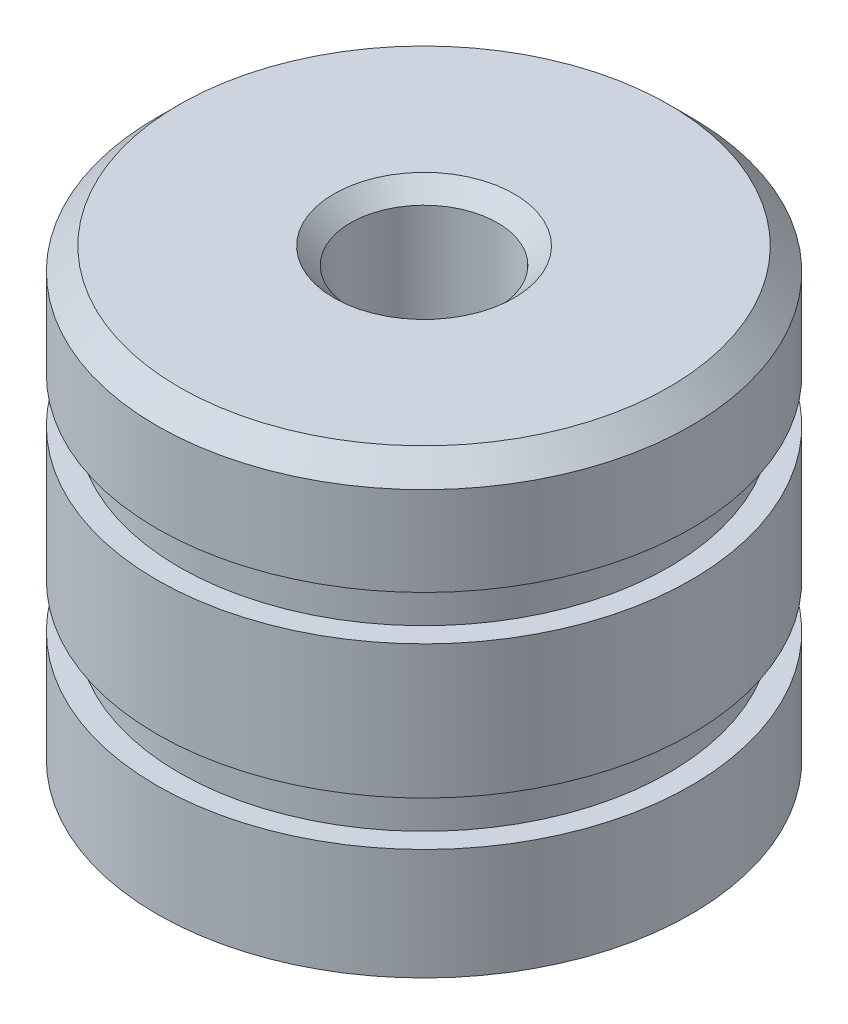
ISO-10303-21;
HEADER;
FILE_DESCRIPTION(('STEP AP214'),'2;1');
FILE_NAME('part.step','',(''),(''),'','','');
FILE_SCHEMA(('AUTOMOTIVE_DESIGN { 1 0 10303 214 1 1 1 1 }'));
ENDSEC;
DATA;
#1=APPLICATION_CONTEXT('core data for automotive mechanical design processes');
#2=APPLICATION_PROTOCOL_DEFINITION('international standard','automotive_design',2000,#1);
#3=PRODUCT_CONTEXT('',#1,'mechanical');
#4=PRODUCT('Part','Part','',(#3));
#5=PRODUCT_RELATED_PRODUCT_CATEGORY('part','',(#4));
#6=PRODUCT_DEFINITION_FORMATION('','',#4);
#7=PRODUCT_DEFINITION_CONTEXT('part definition',#1,'design');
#8=PRODUCT_DEFINITION('design','',#6,#7);
#9=PRODUCT_DEFINITION_SHAPE('','',#8);
#10=(LENGTH_UNIT() NAMED_UNIT(*) SI_UNIT(.MILLI.,.METRE.));
#11=(NAMED_UNIT(*) PLANE_ANGLE_UNIT() SI_UNIT($,.RADIAN.));
#12=(NAMED_UNIT(*) SI_UNIT($,.STERADIAN.) SOLID_ANGLE_UNIT());
#13=UNCERTAINTY_MEASURE_WITH_UNIT(LENGTH_MEASURE(1.E-05),#10,'distance_accuracy_value','');
#14=(GEOMETRIC_REPRESENTATION_CONTEXT(3) GLOBAL_UNCERTAINTY_ASSIGNED_CONTEXT((#13)) GLOBAL_UNIT_ASSIGNED_CONTEXT((#10,
#11,#12)) REPRESENTATION_CONTEXT('',''));
#15=CARTESIAN_POINT('',(0.,0.,0.));
#16=DIRECTION('',(0.,0.,1.));
#17=DIRECTION('',(1.,0.,0.));
#18=AXIS2_PLACEMENT_3D('',#15,#16,#17);
#19=CARTESIAN_POINT('',(0.,5.,0.));
#20=DIRECTION('',(0.,-1.,0.));
#21=DIRECTION('',(0.,0.,-1.));
#22=AXIS2_PLACEMENT_3D('',#19,#20,#21);
#23=CYLINDRICAL_SURFACE('',#22,6.);
#24=CARTESIAN_POINT('',(0.,1.5,0.));
#25=DIRECTION('',(0.,1.,0.));
#26=DIRECTION('',(0.,0.,1.));
#27=AXIS2_PLACEMENT_3D('',#24,#25,#26);
#28=CIRCLE('',#27,6.);
#29=CARTESIAN_POINT('',(0.,1.5,6.));
#30=VERTEX_POINT('',#29);
#31=EDGE_CURVE('E81',#30,#30,#28,.T.);
#32=ORIENTED_EDGE('',*,*,#31,.F.);
#33=EDGE_LOOP('',(#32));
#34=FACE_BOUND('',#33,.T.);
#35=CARTESIAN_POINT('',(0.,-1.5,0.));
#36=DIRECTION('',(0.,1.,0.));
#37=DIRECTION('',(0.,0.,1.));
#38=AXIS2_PLACEMENT_3D('',#35,#36,#37);
#39=CIRCLE('',#38,6.);
#40=CARTESIAN_POINT('',(0.,-1.5,6.));
#41=VERTEX_POINT('',#40);
#42=EDGE_CURVE('E69',#41,#41,#39,.T.);
#43=ORIENTED_EDGE('',*,*,#42,.T.);
#44=EDGE_LOOP('',(#43));
#45=FACE_BOUND('',#44,.T.);
#46=ADVANCED_FACE('F36',(#34,#45),#23,.T.);
#47=CARTESIAN_POINT('',(0.,1.5,0.));
#48=DIRECTION('',(0.,1.,0.));
#49=DIRECTION('',(0.,0.,1.));
#50=AXIS2_PLACEMENT_3D('',#47,#48,#49);
#51=PLANE('',#50);
#52=CARTESIAN_POINT('',(0.,1.5,0.));
#53=DIRECTION('',(0.,1.,0.));
#54=DIRECTION('',(0.,0.,1.));
#55=AXIS2_PLACEMENT_3D('',#52,#53,#54);
#56=CIRCLE('',#55,5.5);
#57=CARTESIAN_POINT('',(0.,1.5,5.5));
#58=VERTEX_POINT('',#57);
#59=EDGE_CURVE('E75',#58,#58,#56,.T.);
#60=ORIENTED_EDGE('',*,*,#59,.F.);
#61=EDGE_LOOP('',(#60));
#62=FACE_BOUND('',#61,.T.);
#63=ORIENTED_EDGE('',*,*,#31,.T.);
#64=EDGE_LOOP('',(#63));
#65=FACE_BOUND('',#64,.T.);
#66=ADVANCED_FACE('F104',(#62,#65),#51,.T.);
#67=CARTESIAN_POINT('',(0.,2.5,0.));
#68=DIRECTION('',(0.,1.,0.));
#69=DIRECTION('',(0.,0.,1.));
#70=AXIS2_PLACEMENT_3D('',#67,#68,#69);
#71=PLANE('',#70);
#72=CARTESIAN_POINT('',(0.,2.5,0.));
#73=DIRECTION('',(0.,1.,0.));
#74=DIRECTION('',(0.,0.,1.));
#75=AXIS2_PLACEMENT_3D('',#72,#73,#74);
#76=CIRCLE('',#75,5.5);
#77=CARTESIAN_POINT('',(0.,2.5,5.5));
#78=VERTEX_POINT('',#77);
#79=EDGE_CURVE('E72',#78,#78,#76,.T.);
#80=ORIENTED_EDGE('',*,*,#79,.T.);
#81=EDGE_LOOP('',(#80));
#82=FACE_BOUND('',#81,.T.);
#83=CARTESIAN_POINT('',(0.,2.5,0.));
#84=DIRECTION('',(0.,1.,0.));
#85=DIRECTION('',(0.,0.,1.));
#86=AXIS2_PLACEMENT_3D('',#83,#84,#85);
#87=CIRCLE('',#86,6.);
#88=CARTESIAN_POINT('',(0.,2.5,6.));
#89=VERTEX_POINT('',#88);
#90=EDGE_CURVE('E78',#89,#89,#87,.T.);
#91=ORIENTED_EDGE('',*,*,#90,.F.);
#92=EDGE_LOOP('',(#91));
#93=FACE_BOUND('',#92,.T.);
#94=ADVANCED_FACE('F109',(#82,#93),#71,.F.);
#95=CARTESIAN_POINT('',(0.,1.5,0.));
#96=DIRECTION('',(0.,1.,0.));
#97=DIRECTION('',(0.,0.,1.));
#98=AXIS2_PLACEMENT_3D('',#95,#96,#97);
#99=CYLINDRICAL_SURFACE('',#98,5.5);
#100=ORIENTED_EDGE('',*,*,#59,.T.);
#101=EDGE_LOOP('',(#100));
#102=FACE_BOUND('',#101,.T.);
#103=ORIENTED_EDGE('',*,*,#79,.F.);
#104=EDGE_LOOP('',(#103));
#105=FACE_BOUND('',#104,.T.);
#106=ADVANCED_FACE('F125',(#102,#105),#99,.T.);
#107=CARTESIAN_POINT('',(0.,5.,0.));
#108=DIRECTION('',(0.,1.,0.));
#109=DIRECTION('',(0.,0.,1.));
#110=AXIS2_PLACEMENT_3D('',#107,#108,#109);
#111=PLANE('',#110);
#112=CARTESIAN_POINT('',(0.,5.,0.));
#113=DIRECTION('',(0.,1.,0.));
#114=DIRECTION('',(0.,0.,1.));
#115=AXIS2_PLACEMENT_3D('',#112,#113,#114);
#116=CIRCLE('',#115,2.025);
#117=CARTESIAN_POINT('',(0.,5.,2.025));
#118=VERTEX_POINT('',#117);
#119=EDGE_CURVE('E62',#118,#118,#116,.T.);
#120=ORIENTED_EDGE('',*,*,#119,.F.);
#121=EDGE_LOOP('',(#120));
#122=FACE_BOUND('',#121,.T.);
#123=CARTESIAN_POINT('',(0.,5.,0.));
#124=DIRECTION('',(0.,1.,0.));
#125=DIRECTION('',(0.,0.,1.));
#126=AXIS2_PLACEMENT_3D('',#123,#124,#125);
#127=CIRCLE('',#126,5.50000000000001);
#128=CARTESIAN_POINT('',(0.,5.,5.50000000000001));
#129=VERTEX_POINT('',#128);
#130=EDGE_CURVE('E43',#129,#129,#127,.T.);
#131=ORIENTED_EDGE('',*,*,#130,.T.);
#132=EDGE_LOOP('',(#131));
#133=FACE_BOUND('',#132,.T.);
#134=ADVANCED_FACE('F91',(#122,#133),#111,.T.);
#135=CARTESIAN_POINT('',(0.,4.5,0.));
#136=DIRECTION('',(0.,1.,0.));
#137=DIRECTION('',(0.,0.,1.));
#138=AXIS2_PLACEMENT_3D('',#135,#136,#137);
#139=CIRCLE('',#138,6.);
#140=CARTESIAN_POINT('',(0.,4.5,6.));
#141=VERTEX_POINT('',#140);
#142=EDGE_CURVE('E11',#141,#141,#139,.F.);
#143=ORIENTED_EDGE('',*,*,#142,.T.);
#144=EDGE_LOOP('',(#143));
#145=FACE_BOUND('',#144,.T.);
#146=ORIENTED_EDGE('',*,*,#90,.T.);
#147=EDGE_LOOP('',(#146));
#148=FACE_BOUND('',#147,.T.);
#149=ADVANCED_FACE('F101',(#145,#148),#23,.T.);
#150=CARTESIAN_POINT('',(0.,-1.5,0.));
#151=DIRECTION('',(0.,-1.,0.));
#152=DIRECTION('',(0.,0.,1.));
#153=AXIS2_PLACEMENT_3D('',#150,#151,#152);
#154=PLANE('',#153);
#155=ORIENTED_EDGE('',*,*,#42,.F.);
#156=EDGE_LOOP('',(#155));
#157=FACE_BOUND('',#156,.T.);
#158=CARTESIAN_POINT('',(0.,-1.5,0.));
#159=DIRECTION('',(0.,1.,0.));
#160=DIRECTION('',(0.,0.,1.));
#161=AXIS2_PLACEMENT_3D('',#158,#159,#160);
#162=CIRCLE('',#161,5.5);
#163=CARTESIAN_POINT('',(0.,-1.5,5.5));
#164=VERTEX_POINT('',#163);
#165=EDGE_CURVE('E59',#164,#164,#162,.T.);
#166=ORIENTED_EDGE('',*,*,#165,.T.);
#167=EDGE_LOOP('',(#166));
#168=FACE_BOUND('',#167,.T.);
#169=ADVANCED_FACE('F116',(#157,#168),#154,.T.);
#170=CARTESIAN_POINT('',(0.,-2.5,0.));
#171=DIRECTION('',(0.,-1.,0.));
#172=DIRECTION('',(0.,0.,1.));
#173=AXIS2_PLACEMENT_3D('',#170,#171,#172);
#174=PLANE('',#173);
#175=CARTESIAN_POINT('',(0.,-2.5,0.));
#176=DIRECTION('',(0.,1.,0.));
#177=DIRECTION('',(0.,0.,1.));
#178=AXIS2_PLACEMENT_3D('',#175,#176,#177);
#179=CIRCLE('',#178,6.);
#180=CARTESIAN_POINT('',(0.,-2.5,6.));
#181=VERTEX_POINT('',#180);
#182=EDGE_CURVE('E67',#181,#181,#179,.T.);
#183=ORIENTED_EDGE('',*,*,#182,.T.);
#184=EDGE_LOOP('',(#183));
#185=FACE_BOUND('',#184,.T.);
#186=CARTESIAN_POINT('',(0.,-2.5,0.));
#187=DIRECTION('',(0.,1.,0.));
#188=DIRECTION('',(0.,0.,1.));
#189=AXIS2_PLACEMENT_3D('',#186,#187,#188);
#190=CIRCLE('',#189,5.5);
#191=CARTESIAN_POINT('',(0.,-2.5,5.5));
#192=VERTEX_POINT('',#191);
#193=EDGE_CURVE('E55',#192,#192,#190,.T.);
#194=ORIENTED_EDGE('',*,*,#193,.F.);
#195=EDGE_LOOP('',(#194));
#196=FACE_BOUND('',#195,.T.);
#197=ADVANCED_FACE('F122',(#185,#196),#174,.F.);
#198=CARTESIAN_POINT('',(0.,-1.5,0.));
#199=DIRECTION('',(0.,-1.,0.));
#200=DIRECTION('',(0.,0.,-1.));
#201=AXIS2_PLACEMENT_3D('',#198,#199,#200);
#202=CYLINDRICAL_SURFACE('',#201,5.5);
#203=ORIENTED_EDGE('',*,*,#165,.F.);
#204=EDGE_LOOP('',(#203));
#205=FACE_BOUND('',#204,.T.);
#206=ORIENTED_EDGE('',*,*,#193,.T.);
#207=EDGE_LOOP('',(#206));
#208=FACE_BOUND('',#207,.T.);
#209=ADVANCED_FACE('F140',(#205,#208),#202,.T.);
#210=CARTESIAN_POINT('',(0.,-5.,0.));
#211=DIRECTION('',(0.,1.,0.));
#212=DIRECTION('',(0.,0.,1.));
#213=AXIS2_PLACEMENT_3D('',#210,#211,#212);
#214=PLANE('',#213);
#215=CARTESIAN_POINT('',(0.,-5.,0.));
#216=DIRECTION('',(0.,1.,0.));
#217=DIRECTION('',(0.,0.,1.));
#218=AXIS2_PLACEMENT_3D('',#215,#216,#217);
#219=CIRCLE('',#218,6.);
#220=CARTESIAN_POINT('',(0.,-5.,6.));
#221=VERTEX_POINT('',#220);
#222=EDGE_CURVE('E84',#221,#221,#219,.T.);
#223=ORIENTED_EDGE('',*,*,#222,.F.);
#224=EDGE_LOOP('',(#223));
#225=FACE_BOUND('',#224,.T.);
#226=ADVANCED_FACE('F99',(#225),#214,.F.);
#227=ORIENTED_EDGE('',*,*,#182,.F.);
#228=EDGE_LOOP('',(#227));
#229=FACE_BOUND('',#228,.T.);
#230=ORIENTED_EDGE('',*,*,#222,.T.);
#231=EDGE_LOOP('',(#230));
#232=FACE_BOUND('',#231,.T.);
#233=ADVANCED_FACE('F94',(#229,#232),#23,.T.);
#234=CARTESIAN_POINT('',(0.,5.,0.));
#235=DIRECTION('',(0.,-1.,0.));
#236=DIRECTION('',(0.,0.,-1.));
#237=AXIS2_PLACEMENT_3D('',#234,#235,#236);
#238=CONICAL_SURFACE('',#237,5.50000000000001,0.785398163397444);
#239=ORIENTED_EDGE('',*,*,#142,.F.);
#240=EDGE_LOOP('',(#239));
#241=FACE_BOUND('',#240,.T.);
#242=ORIENTED_EDGE('',*,*,#130,.F.);
#243=EDGE_LOOP('',(#242));
#244=FACE_BOUND('',#243,.T.);
#245=ADVANCED_FACE('F38',(#241,#244),#238,.T.);
#246=CARTESIAN_POINT('',(0.,-3.,0.));
#247=DIRECTION('',(0.,1.,0.));
#248=DIRECTION('',(0.,0.,1.));
#249=AXIS2_PLACEMENT_3D('',#246,#247,#248);
#250=CONICAL_SURFACE('',#249,1.65,1.02974425867665);
#251=CARTESIAN_POINT('',(0.,-3.99142002139548,0.));
#252=VERTEX_POINT('',#251);
#253=VERTEX_LOOP('',#252);
#254=FACE_BOUND('',#253,.T.);
#255=CARTESIAN_POINT('',(0.,-3.,0.));
#256=DIRECTION('',(0.,1.,0.));
#257=DIRECTION('',(0.,0.,1.));
#258=AXIS2_PLACEMENT_3D('',#255,#256,#257);
#259=CIRCLE('',#258,1.65);
#260=CARTESIAN_POINT('',(0.,-3.,1.65));
#261=VERTEX_POINT('',#260);
#262=EDGE_CURVE('E53',#261,#261,#259,.T.);
#263=ORIENTED_EDGE('',*,*,#262,.T.);
#264=EDGE_LOOP('',(#263));
#265=FACE_BOUND('',#264,.T.);
#266=ADVANCED_FACE('F46',(#254,#265),#250,.F.);
#267=CARTESIAN_POINT('',(0.,5.,0.));
#268=DIRECTION('',(0.,1.,0.));
#269=DIRECTION('',(0.,0.,1.));
#270=AXIS2_PLACEMENT_3D('',#267,#268,#269);
#271=CYLINDRICAL_SURFACE('',#270,1.65);
#272=ORIENTED_EDGE('',*,*,#262,.F.);
#273=EDGE_LOOP('',(#272));
#274=FACE_BOUND('',#273,.T.);
#275=CARTESIAN_POINT('',(0.,4.625,0.));
#276=DIRECTION('',(0.,1.,0.));
#277=DIRECTION('',(0.,0.,1.));
#278=AXIS2_PLACEMENT_3D('',#275,#276,#277);
#279=CIRCLE('',#278,1.65);
#280=CARTESIAN_POINT('',(0.,4.625,1.65));
#281=VERTEX_POINT('',#280);
#282=EDGE_CURVE('E56',#281,#281,#279,.T.);
#283=ORIENTED_EDGE('',*,*,#282,.T.);
#284=EDGE_LOOP('',(#283));
#285=FACE_BOUND('',#284,.T.);
#286=ADVANCED_FACE('F49',(#274,#285),#271,.F.);
#287=CARTESIAN_POINT('',(0.,5.,0.));
#288=DIRECTION('',(0.,1.,0.));
#289=DIRECTION('',(0.,0.,1.));
#290=AXIS2_PLACEMENT_3D('',#287,#288,#289);
#291=CONICAL_SURFACE('',#290,2.025,0.785398163397449);
#292=ORIENTED_EDGE('',*,*,#282,.F.);
#293=EDGE_LOOP('',(#292));
#294=FACE_BOUND('',#293,.T.);
#295=ORIENTED_EDGE('',*,*,#119,.T.);
#296=EDGE_LOOP('',(#295));
#297=FACE_BOUND('',#296,.T.);
#298=ADVANCED_FACE('F159',(#294,#297),#291,.F.);
#299=CLOSED_SHELL('',(#46,#66,#94,#106,#134,#149,#169,#197,#209,#226,#233,#245,#266,#286,#298));
#300=MANIFOLD_SOLID_BREP('B2',#299);
#301=ADVANCED_BREP_SHAPE_REPRESENTATION('',(#18,#300),#14);
#302=SHAPE_DEFINITION_REPRESENTATION(#9,#301);
ENDSEC;
END-ISO-10303-21;
